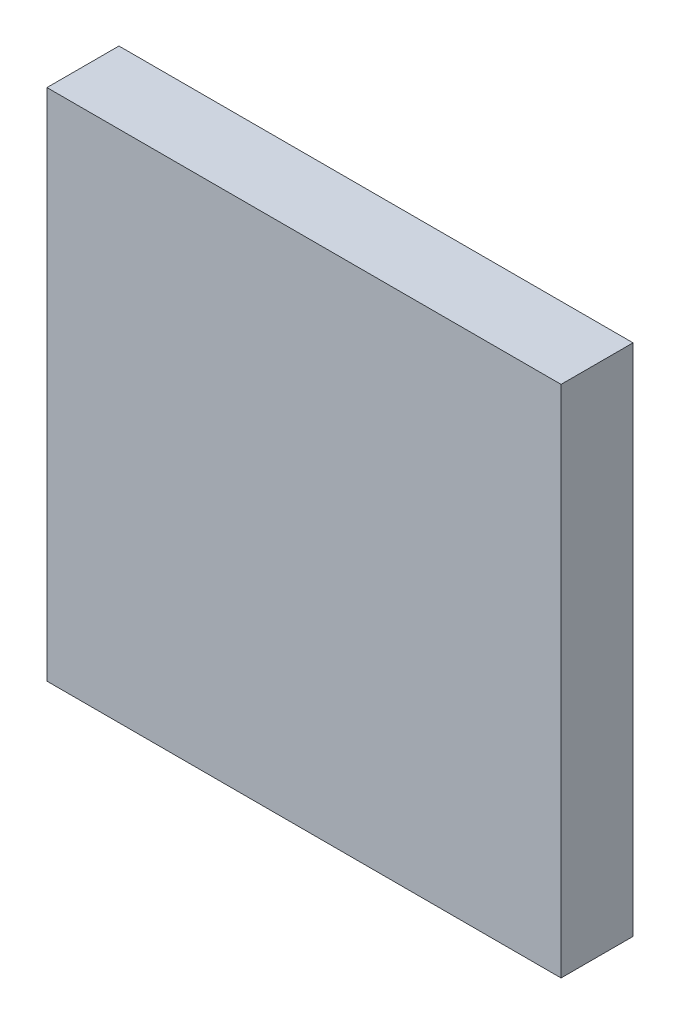
ISO-10303-21;
HEADER;
FILE_DESCRIPTION(('STEP AP214'),'2;1');
FILE_NAME('part.step','',(''),(''),'','','');
FILE_SCHEMA(('AUTOMOTIVE_DESIGN { 1 0 10303 214 1 1 1 1 }'));
ENDSEC;
DATA;
#1=APPLICATION_CONTEXT('core data for automotive mechanical design processes');
#2=APPLICATION_PROTOCOL_DEFINITION('international standard','automotive_design',2000,#1);
#3=PRODUCT_CONTEXT('',#1,'mechanical');
#4=PRODUCT('Part','Part','',(#3));
#5=PRODUCT_RELATED_PRODUCT_CATEGORY('part','',(#4));
#6=PRODUCT_DEFINITION_FORMATION('','',#4);
#7=PRODUCT_DEFINITION_CONTEXT('part definition',#1,'design');
#8=PRODUCT_DEFINITION('design','',#6,#7);
#9=PRODUCT_DEFINITION_SHAPE('','',#8);
#10=(LENGTH_UNIT() NAMED_UNIT(*) SI_UNIT(.MILLI.,.METRE.));
#11=(NAMED_UNIT(*) PLANE_ANGLE_UNIT() SI_UNIT($,.RADIAN.));
#12=(NAMED_UNIT(*) SI_UNIT($,.STERADIAN.) SOLID_ANGLE_UNIT());
#13=UNCERTAINTY_MEASURE_WITH_UNIT(LENGTH_MEASURE(1.E-05),#10,'distance_accuracy_value','');
#14=(GEOMETRIC_REPRESENTATION_CONTEXT(3) GLOBAL_UNCERTAINTY_ASSIGNED_CONTEXT((#13)) GLOBAL_UNIT_ASSIGNED_CONTEXT((#10,
#11,#12)) REPRESENTATION_CONTEXT('',''));
#15=CARTESIAN_POINT('',(0.,0.,0.));
#16=DIRECTION('',(0.,0.,1.));
#17=DIRECTION('',(1.,0.,0.));
#18=AXIS2_PLACEMENT_3D('',#15,#16,#17);
#19=CARTESIAN_POINT('',(-5.00000016,-5.00000016,1.39999974));
#20=DIRECTION('',(0.,0.,1.));
#21=DIRECTION('',(1.,0.,0.));
#22=AXIS2_PLACEMENT_3D('',#19,#20,#21);
#23=PLANE('',#22);
#24=DIRECTION('',(1.,0.,0.));
#25=VECTOR('',#24,1.);
#26=CARTESIAN_POINT('',(-5.00000016,5.00000016,1.39999974));
#27=LINE('',#26,#25);
#28=CARTESIAN_POINT('',(-5.00000016,5.00000016,1.39999974));
#29=VERTEX_POINT('',#28);
#30=CARTESIAN_POINT('',(5.00000016,5.00000016,1.39999974));
#31=VERTEX_POINT('',#30);
#32=EDGE_CURVE('E53',#29,#31,#27,.T.);
#33=ORIENTED_EDGE('',*,*,#32,.F.);
#34=DIRECTION('',(0.,1.,0.));
#35=VECTOR('',#34,1.);
#36=CARTESIAN_POINT('',(-5.00000016,-5.00000016,1.39999974));
#37=LINE('',#36,#35);
#38=CARTESIAN_POINT('',(-5.00000016,-5.00000016,1.39999974));
#39=VERTEX_POINT('',#38);
#40=EDGE_CURVE('E68',#39,#29,#37,.T.);
#41=ORIENTED_EDGE('',*,*,#40,.F.);
#42=DIRECTION('',(1.,0.,0.));
#43=VECTOR('',#42,1.);
#44=CARTESIAN_POINT('',(5.00000016,-5.00000016,1.39999974));
#45=LINE('',#44,#43);
#46=CARTESIAN_POINT('',(5.00000016,-5.00000016,1.39999974));
#47=VERTEX_POINT('',#46);
#48=EDGE_CURVE('E20',#47,#39,#45,.F.);
#49=ORIENTED_EDGE('',*,*,#48,.F.);
#50=DIRECTION('',(0.,1.,0.));
#51=VECTOR('',#50,1.);
#52=CARTESIAN_POINT('',(5.00000016,5.00000016,1.39999974));
#53=LINE('',#52,#51);
#54=EDGE_CURVE('E58',#31,#47,#53,.F.);
#55=ORIENTED_EDGE('',*,*,#54,.F.);
#56=EDGE_LOOP('',(#33,#41,#49,#55));
#57=FACE_BOUND('',#56,.T.);
#58=ADVANCED_FACE('F17',(#57),#23,.T.);
#59=CARTESIAN_POINT('',(5.00000016,-5.00000016,0.));
#60=DIRECTION('',(0.,-1.,0.));
#61=DIRECTION('',(0.,0.,-1.));
#62=AXIS2_PLACEMENT_3D('',#59,#60,#61);
#63=PLANE('',#62);
#64=DIRECTION('',(0.,0.,1.));
#65=VECTOR('',#64,1.);
#66=CARTESIAN_POINT('',(-5.00000016,-5.00000016,0.));
#67=LINE('',#66,#65);
#68=CARTESIAN_POINT('',(-5.00000016,-5.00000016,0.));
#69=VERTEX_POINT('',#68);
#70=EDGE_CURVE('E79',#69,#39,#67,.T.);
#71=ORIENTED_EDGE('',*,*,#70,.F.);
#72=DIRECTION('',(1.,0.,0.));
#73=VECTOR('',#72,1.);
#74=CARTESIAN_POINT('',(-5.00000016,-5.00000016,0.));
#75=LINE('',#74,#73);
#76=CARTESIAN_POINT('',(5.00000016,-5.00000016,0.));
#77=VERTEX_POINT('',#76);
#78=EDGE_CURVE('E74',#69,#77,#75,.T.);
#79=ORIENTED_EDGE('',*,*,#78,.T.);
#80=DIRECTION('',(0.,0.,-1.));
#81=VECTOR('',#80,1.);
#82=CARTESIAN_POINT('',(5.00000016,-5.00000016,0.));
#83=LINE('',#82,#81);
#84=EDGE_CURVE('E63',#47,#77,#83,.T.);
#85=ORIENTED_EDGE('',*,*,#84,.F.);
#86=ORIENTED_EDGE('',*,*,#48,.T.);
#87=EDGE_LOOP('',(#71,#79,#85,#86));
#88=FACE_BOUND('',#87,.T.);
#89=ADVANCED_FACE('F73',(#88),#63,.T.);
#90=CARTESIAN_POINT('',(5.00000016,5.00000016,0.));
#91=DIRECTION('',(1.,0.,0.));
#92=DIRECTION('',(0.,0.,-1.));
#93=AXIS2_PLACEMENT_3D('',#90,#91,#92);
#94=PLANE('',#93);
#95=ORIENTED_EDGE('',*,*,#84,.T.);
#96=DIRECTION('',(0.,1.,0.));
#97=VECTOR('',#96,1.);
#98=CARTESIAN_POINT('',(5.00000016,-5.00000016,0.));
#99=LINE('',#98,#97);
#100=CARTESIAN_POINT('',(5.00000016,5.00000016,0.));
#101=VERTEX_POINT('',#100);
#102=EDGE_CURVE('E84',#77,#101,#99,.T.);
#103=ORIENTED_EDGE('',*,*,#102,.T.);
#104=DIRECTION('',(0.,0.,1.));
#105=VECTOR('',#104,1.);
#106=CARTESIAN_POINT('',(5.00000016,5.00000016,0.));
#107=LINE('',#106,#105);
#108=EDGE_CURVE('E65',#31,#101,#107,.F.);
#109=ORIENTED_EDGE('',*,*,#108,.F.);
#110=ORIENTED_EDGE('',*,*,#54,.T.);
#111=EDGE_LOOP('',(#95,#103,#109,#110));
#112=FACE_BOUND('',#111,.T.);
#113=ADVANCED_FACE('F60',(#112),#94,.T.);
#114=CARTESIAN_POINT('',(-5.00000016,5.00000016,0.));
#115=DIRECTION('',(0.,1.,0.));
#116=DIRECTION('',(0.,0.,1.));
#117=AXIS2_PLACEMENT_3D('',#114,#115,#116);
#118=PLANE('',#117);
#119=ORIENTED_EDGE('',*,*,#108,.T.);
#120=DIRECTION('',(1.,0.,0.));
#121=VECTOR('',#120,1.);
#122=CARTESIAN_POINT('',(-5.00000016,5.00000016,0.));
#123=LINE('',#122,#121);
#124=CARTESIAN_POINT('',(-5.00000016,5.00000016,0.));
#125=VERTEX_POINT('',#124);
#126=EDGE_CURVE('E26',#101,#125,#123,.F.);
#127=ORIENTED_EDGE('',*,*,#126,.T.);
#128=DIRECTION('',(0.,0.,1.));
#129=VECTOR('',#128,1.);
#130=CARTESIAN_POINT('',(-5.00000016,5.00000016,0.));
#131=LINE('',#130,#129);
#132=EDGE_CURVE('E34',#29,#125,#131,.F.);
#133=ORIENTED_EDGE('',*,*,#132,.F.);
#134=ORIENTED_EDGE('',*,*,#32,.T.);
#135=EDGE_LOOP('',(#119,#127,#133,#134));
#136=FACE_BOUND('',#135,.T.);
#137=ADVANCED_FACE('F88',(#136),#118,.T.);
#138=CARTESIAN_POINT('',(-5.00000016,-5.00000016,0.));
#139=DIRECTION('',(-1.,0.,0.));
#140=DIRECTION('',(0.,0.,1.));
#141=AXIS2_PLACEMENT_3D('',#138,#139,#140);
#142=PLANE('',#141);
#143=ORIENTED_EDGE('',*,*,#132,.T.);
#144=DIRECTION('',(0.,1.,0.));
#145=VECTOR('',#144,1.);
#146=CARTESIAN_POINT('',(-5.00000016,-5.00000016,0.));
#147=LINE('',#146,#145);
#148=EDGE_CURVE('E11',#125,#69,#147,.F.);
#149=ORIENTED_EDGE('',*,*,#148,.T.);
#150=ORIENTED_EDGE('',*,*,#70,.T.);
#151=ORIENTED_EDGE('',*,*,#40,.T.);
#152=EDGE_LOOP('',(#143,#149,#150,#151));
#153=FACE_BOUND('',#152,.T.);
#154=ADVANCED_FACE('F91',(#153),#142,.T.);
#155=CARTESIAN_POINT('',(-5.00000016,-5.00000016,0.));
#156=DIRECTION('',(0.,0.,1.));
#157=DIRECTION('',(1.,0.,0.));
#158=AXIS2_PLACEMENT_3D('',#155,#156,#157);
#159=PLANE('',#158);
#160=ORIENTED_EDGE('',*,*,#126,.F.);
#161=ORIENTED_EDGE('',*,*,#102,.F.);
#162=ORIENTED_EDGE('',*,*,#78,.F.);
#163=ORIENTED_EDGE('',*,*,#148,.F.);
#164=EDGE_LOOP('',(#160,#161,#162,#163));
#165=FACE_BOUND('',#164,.T.);
#166=ADVANCED_FACE('F90',(#165),#159,.F.);
#167=CLOSED_SHELL('',(#58,#89,#113,#137,#154,#166));
#168=MANIFOLD_SOLID_BREP('B1',#167);
#169=ADVANCED_BREP_SHAPE_REPRESENTATION('',(#18,#168),#14);
#170=SHAPE_DEFINITION_REPRESENTATION(#9,#169);
ENDSEC;
END-ISO-10303-21;
